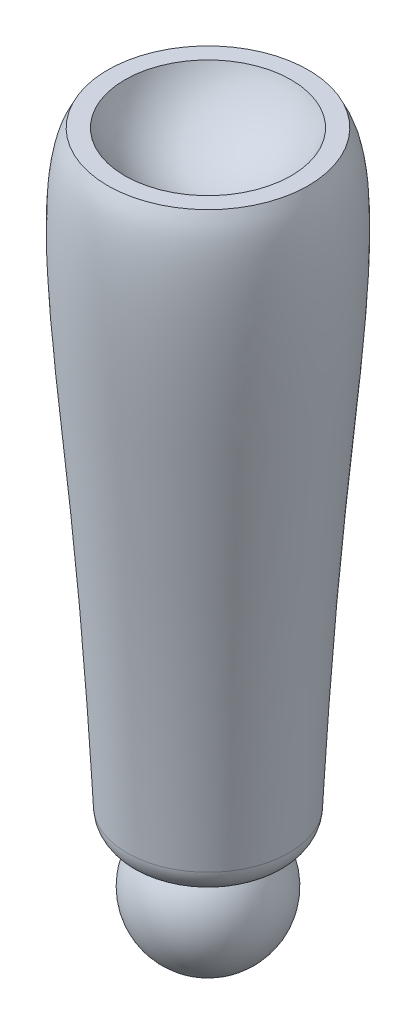
ISO-10303-21;
HEADER;
FILE_DESCRIPTION(('STEP AP214'),'2;1');
FILE_NAME('part.step','',(''),(''),'','','');
FILE_SCHEMA(('AUTOMOTIVE_DESIGN { 1 0 10303 214 1 1 1 1 }'));
ENDSEC;
DATA;
#1=APPLICATION_CONTEXT('core data for automotive mechanical design processes');
#2=APPLICATION_PROTOCOL_DEFINITION('international standard','automotive_design',2000,#1);
#3=PRODUCT_CONTEXT('',#1,'mechanical');
#4=PRODUCT('Part','Part','',(#3));
#5=PRODUCT_RELATED_PRODUCT_CATEGORY('part','',(#4));
#6=PRODUCT_DEFINITION_FORMATION('','',#4);
#7=PRODUCT_DEFINITION_CONTEXT('part definition',#1,'design');
#8=PRODUCT_DEFINITION('design','',#6,#7);
#9=PRODUCT_DEFINITION_SHAPE('','',#8);
#10=(LENGTH_UNIT() NAMED_UNIT(*) SI_UNIT(.MILLI.,.METRE.));
#11=(NAMED_UNIT(*) PLANE_ANGLE_UNIT() SI_UNIT($,.RADIAN.));
#12=(NAMED_UNIT(*) SI_UNIT($,.STERADIAN.) SOLID_ANGLE_UNIT());
#13=UNCERTAINTY_MEASURE_WITH_UNIT(LENGTH_MEASURE(1.E-05),#10,'distance_accuracy_value','');
#14=(GEOMETRIC_REPRESENTATION_CONTEXT(3) GLOBAL_UNCERTAINTY_ASSIGNED_CONTEXT((#13)) GLOBAL_UNIT_ASSIGNED_CONTEXT((#10,
#11,#12)) REPRESENTATION_CONTEXT('',''));
#15=CARTESIAN_POINT('',(0.,0.,0.));
#16=DIRECTION('',(0.,0.,1.));
#17=DIRECTION('',(1.,0.,0.));
#18=AXIS2_PLACEMENT_3D('',#15,#16,#17);
#19=CARTESIAN_POINT('',(1.32722796261031E-05,-162.31971696909,-0.0827450462317538));
#20=DIRECTION('',(0.,1.,0.));
#21=DIRECTION('',(0.,0.,1.));
#22=AXIS2_PLACEMENT_3D('',#19,#20,#21);
#23=PLANE('',#22);
#24=CARTESIAN_POINT('',(1.32722795408896E-05,-162.31971696909,-0.0827450462317538));
#25=DIRECTION('',(0.,1.,0.));
#26=DIRECTION('',(0.,0.,1.));
#27=AXIS2_PLACEMENT_3D('',#24,#25,#26);
#28=CIRCLE('',#27,24.9967477707206);
#29=CARTESIAN_POINT('',(13.3306257436937,-162.31971696909,-21.2282450462318));
#30=VERTEX_POINT('',#29);
#31=CARTESIAN_POINT('',(-13.3305991991346,-162.31971696909,-21.2282450462318));
#32=VERTEX_POINT('',#31);
#33=EDGE_CURVE('E75',#30,#32,#28,.F.);
#34=ORIENTED_EDGE('',*,*,#33,.F.);
#35=DIRECTION('',(1.,0.,0.));
#36=VECTOR('',#35,1.);
#37=CARTESIAN_POINT('',(-194.414215741425,-162.31971696909,-21.2282450462318));
#38=LINE('',#37,#36);
#39=CARTESIAN_POINT('',(17.8139505736692,-162.31971696909,-21.2282450462318));
#40=VERTEX_POINT('',#39);
#41=EDGE_CURVE('E68',#30,#40,#38,.T.);
#42=ORIENTED_EDGE('',*,*,#41,.T.);
#43=CARTESIAN_POINT('',(1.32722795408896E-05,-162.31971696909,-0.0827450462317538));
#44=DIRECTION('',(0.,1.,0.));
#45=DIRECTION('',(0.,0.,1.));
#46=AXIS2_PLACEMENT_3D('',#43,#44,#45);
#47=CIRCLE('',#46,27.6490240773132);
#48=CARTESIAN_POINT('',(-17.8139240291102,-162.31971696909,-21.2282450462317));
#49=VERTEX_POINT('',#48);
#50=EDGE_CURVE('E119',#40,#49,#47,.F.);
#51=ORIENTED_EDGE('',*,*,#50,.T.);
#52=EDGE_CURVE('E55',#49,#32,#38,.T.);
#53=ORIENTED_EDGE('',*,*,#52,.T.);
#54=EDGE_LOOP('',(#34,#42,#51,#53));
#55=FACE_BOUND('',#54,.T.);
#56=ADVANCED_FACE('F36',(#55),#23,.F.);
#57=CARTESIAN_POINT('',(-194.414215741425,-135.88784196909,-42.4419275212938));
#58=DIRECTION('',(0.,0.62592095974027,0.779886499535554));
#59=DIRECTION('',(0.,-0.779886499535554,0.62592095974027));
#60=AXIS2_PLACEMENT_3D('',#57,#58,#59);
#61=PLANE('',#60);
#62=CARTESIAN_POINT('',(1.32722795408896E-05,-186.188943785365,-2.07129161006042));
#63=DIRECTION('',(0.,0.62592095974027,0.779886499535554));
#64=DIRECTION('',(0.,-0.779886499535554,0.62592095974027));
#65=AXIS2_PLACEMENT_3D('',#62,#63,#64);
#66=CIRCLE('',#65,33.3831406944502);
#67=EDGE_CURVE('E11',#32,#30,#66,.F.);
#68=ORIENTED_EDGE('',*,*,#67,.F.);
#69=ORIENTED_EDGE('',*,*,#52,.F.);
#70=CARTESIAN_POINT('',(26.8790454737556,-148.894386349629,-32.0031409203979));
#71=CARTESIAN_POINT('',(27.1055658052952,-149.15208436486,-31.7963177620115));
#72=CARTESIAN_POINT('',(27.3211290923448,-149.415786244221,-31.5846760250242));
#73=CARTESIAN_POINT('',(27.7277989772624,-149.954875456436,-31.1520140449847));
#74=CARTESIAN_POINT('',(27.9188724514648,-150.230277958785,-30.9309816272057));
#75=CARTESIAN_POINT('',(28.2750572928859,-150.794379611781,-30.4782451735751));
#76=CARTESIAN_POINT('',(28.4399089874673,-151.083179071153,-30.2464606319905));
#77=CARTESIAN_POINT('',(28.7381267826506,-151.670431438559,-29.7751438882908));
#78=CARTESIAN_POINT('',(28.8715068854969,-151.968879986092,-29.5356151858244));
#79=CARTESIAN_POINT('',(29.0794460026597,-152.511678582317,-29.0999761300165));
#80=CARTESIAN_POINT('',(29.160460890275,-152.754528249061,-28.9050699525519));
#81=CARTESIAN_POINT('',(29.2985192087608,-153.244276403729,-28.5120080965208));
#82=CARTESIAN_POINT('',(29.3555724200603,-153.4911731969,-28.3138537781293));
#83=CARTESIAN_POINT('',(29.4436579295575,-153.986996503341,-27.915916129492));
#84=CARTESIAN_POINT('',(29.4747729080244,-154.235913993625,-27.7161400409103));
#85=CARTESIAN_POINT('',(29.5093521545412,-154.734920583945,-27.3156475537141));
#86=CARTESIAN_POINT('',(29.5128220381489,-154.985009435714,-27.1149313543534));
#87=CARTESIAN_POINT('',(29.4923345637564,-155.439341803577,-26.7502934847363));
#88=CARTESIAN_POINT('',(29.4732098197557,-155.643720845746,-26.5862630440229));
#89=CARTESIAN_POINT('',(29.4142852247819,-156.050645280426,-26.2596738123226));
#90=CARTESIAN_POINT('',(29.3744895922459,-156.253191038489,-26.097114727951));
#91=CARTESIAN_POINT('',(29.2734933352137,-156.655081730899,-25.7745654748821));
#92=CARTESIAN_POINT('',(29.212287410875,-156.854425859932,-25.6145759525123));
#93=CARTESIAN_POINT('',(29.0680039545436,-157.248264367308,-25.2984892185251));
#94=CARTESIAN_POINT('',(28.9849261387206,-157.442758682677,-25.1423920574474));
#95=CARTESIAN_POINT('',(28.7962233472048,-157.826279777096,-24.8345858681598));
#96=CARTESIAN_POINT('',(28.690471600201,-158.015268733041,-24.6829071959991));
#97=CARTESIAN_POINT('',(28.456987920958,-158.384814941308,-24.3863169646197));
#98=CARTESIAN_POINT('',(28.3292559976794,-158.565372197067,-24.2414054026424));
#99=CARTESIAN_POINT('',(28.0526409930231,-158.916217524071,-23.9598241162251));
#100=CARTESIAN_POINT('',(27.9037695349936,-159.086511165842,-23.8231499209946));
#101=CARTESIAN_POINT('',(27.5860561390149,-159.415350838025,-23.5592299232306));
#102=CARTESIAN_POINT('',(27.4172156647242,-159.573897728049,-23.4319834307902));
#103=CARTESIAN_POINT('',(27.078644732794,-159.8630746032,-23.1998959830179));
#104=CARTESIAN_POINT('',(26.9106132332816,-159.99491865993,-23.09408063864));
#105=CARTESIAN_POINT('',(26.5611315188825,-160.247267474882,-22.8915506390335));
#106=CARTESIAN_POINT('',(26.3796826517426,-160.367773369244,-22.7948350719628));
#107=CARTESIAN_POINT('',(26.0049132221054,-160.597038354135,-22.6108316824139));
#108=CARTESIAN_POINT('',(25.8115895777797,-160.705794374875,-22.5235463236858));
#109=CARTESIAN_POINT('',(25.4147574546156,-160.911369183353,-22.3585561853797));
#110=CARTESIAN_POINT('',(25.2112468506426,-161.008185465591,-22.2808534166658));
#111=CARTESIAN_POINT('',(24.7275060275937,-161.219765809116,-22.1110433587147));
#112=CARTESIAN_POINT('',(24.4440073849993,-161.329999956001,-22.0225716861634));
#113=CARTESIAN_POINT('',(23.8655436095446,-161.530307372585,-21.8618090488996));
#114=CARTESIAN_POINT('',(23.5705747999883,-161.620374114165,-21.7895233235229));
#115=CARTESIAN_POINT('',(22.9722238660815,-161.781667659871,-21.6600724213873));
#116=CARTESIAN_POINT('',(22.6688386829468,-161.852887512636,-21.6029128236487));
#117=CARTESIAN_POINT('',(22.0563952035747,-161.978059745331,-21.5024521488356));
#118=CARTESIAN_POINT('',(21.7473373346071,-162.032013420161,-21.4591500324998));
#119=CARTESIAN_POINT('',(20.7707056115559,-162.177220948466,-21.3426094390517));
#120=CARTESIAN_POINT('',(20.0962487467364,-162.24083582518,-21.2915534396083));
#121=CARTESIAN_POINT('',(19.0814703815551,-162.296361288259,-21.2469898381598));
#122=CARTESIAN_POINT('',(18.7423505208991,-162.30821202038,-21.2374786828474));
#123=CARTESIAN_POINT('',(18.0637472932442,-162.320629979781,-21.2275122825178));
#124=CARTESIAN_POINT('',(17.724263964804,-162.321198304285,-21.2270561568901));
#125=CARTESIAN_POINT('',(17.0425187485754,-162.312918261271,-21.2337015501271));
#126=CARTESIAN_POINT('',(16.7002589991793,-162.30398610637,-21.2408703150328));
#127=CARTESIAN_POINT('',(16.016222907079,-162.278366328505,-21.261432224951));
#128=CARTESIAN_POINT('',(15.6744465768602,-162.261678508775,-21.2748255278837));
#129=CARTESIAN_POINT('',(14.9917250136385,-162.22219198099,-21.3065166077812));
#130=CARTESIAN_POINT('',(14.6507793741712,-162.199397425284,-21.324811052156));
#131=CARTESIAN_POINT('',(13.9694451339348,-162.149163994824,-21.3651273764203));
#132=CARTESIAN_POINT('',(13.6290565587477,-162.121724912505,-21.3871494228976));
#133=CARTESIAN_POINT('',(12.6338079280588,-162.036644570904,-21.455433165598));
#134=CARTESIAN_POINT('',(11.9795850933083,-161.974562021538,-21.5052593504404));
#135=CARTESIAN_POINT('',(10.6717306170474,-161.84663860489,-21.6079280692472));
#136=CARTESIAN_POINT('',(10.0180990262679,-161.780797441391,-21.6607708409482));
#137=CARTESIAN_POINT('',(8.71023229435484,-161.652318054447,-21.7638857701468));
#138=CARTESIAN_POINT('',(8.05599710100058,-161.589680141136,-21.8141576787376));
#139=CARTESIAN_POINT('',(6.74621395654262,-161.473369099316,-21.907506542922));
#140=CARTESIAN_POINT('',(6.0906660759899,-161.419695501444,-21.9505838752167));
#141=CARTESIAN_POINT('',(4.78443861132814,-161.326307700627,-22.0255350148383));
#142=CARTESIAN_POINT('',(4.13377508300827,-161.286460557556,-22.0575155171919));
#143=CARTESIAN_POINT('',(2.8311073124246,-161.223159352985,-22.1083197697861));
#144=CARTESIAN_POINT('',(2.17910307807423,-161.199705195005,-22.1271435974608));
#145=CARTESIAN_POINT('',(0.874586920062719,-161.171018477117,-22.1501669707372));
#146=CARTESIAN_POINT('',(0.222075168728485,-161.165781262056,-22.1543702524709));
#147=CARTESIAN_POINT('',(-1.08275194528825,-161.173927504748,-22.1478322446357));
#148=CARTESIAN_POINT('',(-1.73506730956526,-161.187310807004,-22.1370910798672));
#149=CARTESIAN_POINT('',(-2.88657752757603,-161.226463038296,-22.1056682994995));
#150=CARTESIAN_POINT('',(-3.38598408399595,-161.248613160421,-22.087891064342));
#151=CARTESIAN_POINT('',(-4.38396064330974,-161.302190806154,-22.0448907412718));
#152=CARTESIAN_POINT('',(-4.88253066208423,-161.333618151596,-22.0196677963523));
#153=CARTESIAN_POINT('',(-5.87890782645448,-161.404292360271,-21.9629461214046));
#154=CARTESIAN_POINT('',(-6.37671466789556,-161.443541787029,-21.9314453339436));
#155=CARTESIAN_POINT('',(-7.37149289280398,-161.52794905302,-21.8637017879668));
#156=CARTESIAN_POINT('',(-7.86846427232398,-161.57310692009,-21.8274590071096));
#157=CARTESIAN_POINT('',(-8.86449728552076,-161.667273535446,-21.7518828068617));
#158=CARTESIAN_POINT('',(-9.36355585916118,-161.716301612529,-21.7125338745749));
#159=CARTESIAN_POINT('',(-10.361541293799,-161.815242619822,-21.6331258449715));
#160=CARTESIAN_POINT('',(-10.8604681503527,-161.865155576769,-21.5930667261963));
#161=CARTESIAN_POINT('',(-11.8585301286412,-161.962666436736,-21.5148065035977));
#162=CARTESIAN_POINT('',(-12.3576651229449,-162.0102651167,-21.4766047762139));
#163=CARTESIAN_POINT('',(-13.3567970039365,-162.099516388925,-21.4049735298693));
#164=CARTESIAN_POINT('',(-13.8567938195372,-162.141169449889,-21.3715436347362));
#165=CARTESIAN_POINT('',(-14.8069054221324,-162.21060363147,-21.3158171801822));
#166=CARTESIAN_POINT('',(-15.2568984196062,-162.239367132795,-21.2927321820885));
#167=CARTESIAN_POINT('',(-16.1579747436587,-162.285260575334,-21.2558990433992));
#168=CARTESIAN_POINT('',(-16.6090582116906,-162.302388915898,-21.2421521874516));
#169=CARTESIAN_POINT('',(-17.5113983645621,-162.321069509272,-21.2271595251346));
#170=CARTESIAN_POINT('',(-17.962654479291,-162.322636520535,-21.2259018739321));
#171=CARTESIAN_POINT('',(-18.8645947012474,-162.305813713893,-21.2394035146008));
#172=CARTESIAN_POINT('',(-19.315278911727,-162.287428246494,-21.2541593148437));
#173=CARTESIAN_POINT('',(-20.1266844298387,-162.231792569767,-21.298811371513));
#174=CARTESIAN_POINT('',(-20.4878849655246,-162.198897633056,-21.3252121751799));
#175=CARTESIAN_POINT('',(-21.2067591926684,-162.114230505109,-21.39316428105));
#176=CARTESIAN_POINT('',(-21.5644325750376,-162.062456674327,-21.4347168991189));
#177=CARTESIAN_POINT('',(-22.2730098798028,-161.937379835011,-21.5351010131567));
#178=CARTESIAN_POINT('',(-22.6239239911693,-161.864112463894,-21.5939039072638));
#179=CARTESIAN_POINT('',(-23.3159771506613,-161.69343881725,-21.7308830866359));
#180=CARTESIAN_POINT('',(-23.6571204375275,-161.596043191472,-21.8090508246308));
#181=CARTESIAN_POINT('',(-24.2287653877813,-161.406919932784,-21.9608372854266));
#182=CARTESIAN_POINT('',(-24.4627978220492,-161.321660735228,-22.0292645742602));
#183=CARTESIAN_POINT('',(-24.9217418797484,-161.137364149648,-22.1771772459012));
#184=CARTESIAN_POINT('',(-25.1466560057226,-161.038330575553,-22.256659567727));
#185=CARTESIAN_POINT('',(-25.5852879005868,-160.826263273459,-22.4268604486699));
#186=CARTESIAN_POINT('',(-25.7990093862661,-160.713234235483,-22.51757524367));
#187=CARTESIAN_POINT('',(-26.2132193102489,-160.473243003878,-22.710187299533));
#188=CARTESIAN_POINT('',(-26.4137075833629,-160.346280636373,-22.8120846999455));
#189=CARTESIAN_POINT('',(-26.8005433023294,-160.078075017931,-23.0273410458403));
#190=CARTESIAN_POINT('',(-26.9867969227483,-159.936749296354,-23.1407661805727));
#191=CARTESIAN_POINT('',(-27.3418547577779,-159.641326575674,-23.3778664162696));
#192=CARTESIAN_POINT('',(-27.5106588303569,-159.487229472637,-23.5015416006504));
#193=CARTESIAN_POINT('',(-27.8291754160137,-159.16746758034,-23.758175957873));
#194=CARTESIAN_POINT('',(-27.9788879303661,-159.001802791853,-23.8911351300949));
#195=CARTESIAN_POINT('',(-28.2579747530849,-158.660374166466,-24.165158764319));
#196=CARTESIAN_POINT('',(-28.3873501160213,-158.484610853865,-24.3062228055301));
#197=CARTESIAN_POINT('',(-28.6146820529867,-158.140212886209,-24.5826295731504));
#198=CARTESIAN_POINT('',(-28.7143888256716,-157.972277976778,-24.7174106980297));
#199=CARTESIAN_POINT('',(-28.8959336132085,-157.630573191618,-24.9916559724415));
#200=CARTESIAN_POINT('',(-28.9777655905601,-157.456801367173,-25.1311216859742));
#201=CARTESIAN_POINT('',(-29.123489831313,-157.104819024646,-25.4136155178037));
#202=CARTESIAN_POINT('',(-29.1873880932703,-156.926610012503,-25.5566424274652));
#203=CARTESIAN_POINT('',(-29.2975471038987,-156.566854108543,-25.8453751607699));
#204=CARTESIAN_POINT('',(-29.343801243371,-156.385305992594,-25.9910819668781));
#205=CARTESIAN_POINT('',(-29.4213750259596,-156.008881928468,-26.2931922247522));
#206=CARTESIAN_POINT('',(-29.4516087565558,-155.813869724874,-26.4497050323297));
#207=CARTESIAN_POINT('',(-29.493382434931,-155.422608843092,-26.7637230167156));
#208=CARTESIAN_POINT('',(-29.5049149964859,-155.226359707069,-26.9212285609722));
#209=CARTESIAN_POINT('',(-29.5126283628587,-154.637362643487,-27.3939455621526));
#210=CARTESIAN_POINT('',(-29.4819520884661,-154.24422615817,-27.7094688675888));
#211=CARTESIAN_POINT('',(-29.3730401241236,-153.568382322653,-28.251887312341));
#212=CARTESIAN_POINT('',(-29.3096002185177,-153.284078156775,-28.4800640232736));
#213=CARTESIAN_POINT('',(-29.1510241073392,-152.720751826569,-28.9321782186843));
#214=CARTESIAN_POINT('',(-29.0558744253035,-152.441731961412,-29.1561138578957));
#215=CARTESIAN_POINT('',(-28.8365659487695,-151.890249612249,-29.598722316272));
#216=CARTESIAN_POINT('',(-28.7123568886805,-151.617799403275,-29.8173852837471));
#217=CARTESIAN_POINT('',(-28.4377046623809,-151.081037799564,-30.2481791727898));
#218=CARTESIAN_POINT('',(-28.2872561490938,-150.816728076636,-30.460308752597));
#219=CARTESIAN_POINT('',(-27.9440167596141,-150.267324582752,-30.9012487642286));
#220=CARTESIAN_POINT('',(-27.7483477023473,-149.983328380657,-31.1291783097245));
#221=CARTESIAN_POINT('',(-27.3318568906271,-149.428954307945,-31.5741076062999));
#222=CARTESIAN_POINT('',(-27.1111862757137,-149.158507505596,-31.7911626805782));
#223=CARTESIAN_POINT('',(-26.8790189291965,-148.894386349629,-32.0031409203979));
#224=B_SPLINE_CURVE_WITH_KNOTS('',3,(#70,#71,#72,#73,#74,#75,#76,#77,#78,#79,#80,#81,#82,#83,
#84,#85,#86,#87,#88,#89,#90,#91,#92,#93,#94,#95,#96,#97,#98,#99,#100,#101,#102,#103,#104,#105,
#106,#107,#108,#109,#110,#111,#112,#113,#114,#115,#116,#117,#118,#119,#120,#121,#122,#123,#124,
#125,#126,#127,#128,#129,#130,#131,#132,#133,#134,#135,#136,#137,#138,#139,#140,#141,#142,#143,
#144,#145,#146,#147,#148,#149,#150,#151,#152,#153,#154,#155,#156,#157,#158,#159,#160,#161,#162,
#163,#164,#165,#166,#167,#168,#169,#170,#171,#172,#173,#174,#175,#176,#177,#178,#179,#180,#181,
#182,#183,#184,#185,#186,#187,#188,#189,#190,#191,#192,#193,#194,#195,#196,#197,#198,#199,#200,
#201,#202,#203,#204,#205,#206,#207,#208,#209,#210,#211,#212,#213,#214,#215,#216,#217,#218,#219,
#220,#221,#222,#223),.UNSPECIFIED.,.F.,.F.,(4,2,2,2,2,2,2,2,2,2,2,2,2,2,2,2,2,2,2,2,2,2,2,2,2,2,
2,2,2,2,2,2,2,2,2,2,2,2,2,2,2,2,2,2,2,2,2,2,2,2,2,2,2,2,2,2,2,2,2,2,2,2,2,2,2,2,2,2,2,2,2,2,2,2,
2,2,4),(0.,1.20186512041241,2.40533904232176,3.6200745240756,4.83426852601993,5.79869677635982,
6.76273099287633,7.72368039111945,8.68443458639425,9.47195446354291,10.2593136897085,
11.0468679546077,11.8344324400521,12.6265207489878,13.4186087350173,14.2102628742734,
15.0018590239879,15.7161074581448,16.4302842447251,17.1446471692529,17.8591597455196,
18.8080466070771,19.757240177471,20.7067833556974,21.6562553049064,23.6886012743598,
24.7068380663272,25.7249758332958,26.7521678773003,27.7793859831877,28.8059073848219,
29.8324746742025,31.8095223089494,33.7867259701206,35.7641206999906,37.7414118629169,
39.6991274347447,41.6568314842714,43.6140352256622,45.5712226226557,47.0717139598088,
48.5721764822305,50.0731315612002,51.574093712003,53.0830945290336,54.592141018861,
56.1006773455768,57.6090946858103,58.9634283283311,60.3179482487679,61.6711834119578,
63.0241235703629,64.1144082391619,65.2047876167484,66.2933692090328,67.3814711757007,
68.1557161513162,68.9297471746893,69.7035195107734,70.4773015039881,71.255808522137,
72.0343218764965,72.8128351788758,73.5913080986203,74.3024006753577,75.0137330649484,
75.7248272403002,76.4361875189118,77.1910374225639,77.9461853895935,79.4559457799694,
80.5647139027805,81.6739538475431,82.7851268794666,83.8965266113911,85.1355214153559,
86.3673900901502),.UNSPECIFIED.);
#225=CARTESIAN_POINT('',(-26.8799945784904,-148.895496349627,-32.002250057093));
#226=VERTEX_POINT('',#225);
#227=EDGE_CURVE('E127',#49,#226,#224,.T.);
#228=ORIENTED_EDGE('',*,*,#227,.T.);
#229=CARTESIAN_POINT('',(26.8800211230494,-148.895496349627,-32.002250057093));
#230=CARTESIAN_POINT('',(26.4578530275185,-148.415180222649,-32.3877419605377));
#231=CARTESIAN_POINT('',(26.023310416591,-147.941391777371,-32.7679948801089));
#232=CARTESIAN_POINT('',(25.1278672154922,-147.007801919993,-33.5172750123867));
#233=CARTESIAN_POINT('',(24.6669173921624,-146.548029255434,-33.886279152905));
#234=CARTESIAN_POINT('',(23.7183634240472,-145.64497455661,-34.6110523912193));
#235=CARTESIAN_POINT('',(23.2307420240034,-145.201703517311,-34.96681266468));
#236=CARTESIAN_POINT('',(22.2222604881301,-144.328785930946,-35.6673984726879));
#237=CARTESIAN_POINT('',(21.7010646478091,-143.899374767842,-36.0120350928803));
#238=CARTESIAN_POINT('',(20.63066179985,-143.062764541601,-36.6834813559568));
#239=CARTESIAN_POINT('',(20.0814708196043,-142.655553039345,-37.0103009822248));
#240=CARTESIAN_POINT('',(18.9546530034331,-141.866092100526,-37.6439061911845));
#241=CARTESIAN_POINT('',(18.3770366241818,-141.483833603279,-37.9506990457963));
#242=CARTESIAN_POINT('',(17.1134746039479,-140.697764693858,-38.5815818813113));
#243=CARTESIAN_POINT('',(16.4234039561368,-140.297963880353,-38.9024538402991));
#244=CARTESIAN_POINT('',(15.0068562016702,-139.539514066328,-39.5111701545215));
#245=CARTESIAN_POINT('',(14.2803777081468,-139.180866635161,-39.7990132502263));
#246=CARTESIAN_POINT('',(12.7957796516041,-138.5117585114,-40.3360257504343));
#247=CARTESIAN_POINT('',(12.0378076243956,-138.201099575756,-40.5853542607572));
#248=CARTESIAN_POINT('',(10.490284427218,-137.63194080123,-41.0421494567354));
#249=CARTESIAN_POINT('',(9.70073917174213,-137.373431247737,-41.2496239391384));
#250=CARTESIAN_POINT('',(8.21827542531938,-136.949535648575,-41.5898338804768));
#251=CARTESIAN_POINT('',(7.52921184263371,-136.7759384227,-41.7291594647667));
#252=CARTESIAN_POINT('',(6.13522060279313,-136.473094502886,-41.972215803163));
#253=CARTESIAN_POINT('',(5.43029448247974,-136.343843532006,-42.0759499898539));
#254=CARTESIAN_POINT('',(4.00875152895405,-136.132159382088,-42.2458433606935));
#255=CARTESIAN_POINT('',(3.29213183035949,-136.049737860842,-42.3119931885364));
#256=CARTESIAN_POINT('',(1.85239111959096,-135.933465658216,-42.4053108811779));
#257=CARTESIAN_POINT('',(1.1292699238481,-135.899616352626,-42.4324776417947));
#258=CARTESIAN_POINT('',(-0.318930632503071,-135.881210863538,-42.4472495110364));
#259=CARTESIAN_POINT('',(-1.04401131422788,-135.896717575241,-42.4348041412583));
#260=CARTESIAN_POINT('',(-2.48962429436353,-135.97682201642,-42.3705139545047));
#261=CARTESIAN_POINT('',(-3.21015693213367,-136.041416038445,-42.3186721130528));
#262=CARTESIAN_POINT('',(-4.64145551141852,-136.218321447842,-42.1766914483037));
#263=CARTESIAN_POINT('',(-5.35222178544401,-136.330631206482,-42.0865539321932));
#264=CARTESIAN_POINT('',(-6.75959391921356,-136.600772694715,-41.8697438967822));
#265=CARTESIAN_POINT('',(-7.45619462482236,-136.758620686993,-41.7430583253843));
#266=CARTESIAN_POINT('',(-8.8238090314899,-137.115029014263,-41.4570122886889));
#267=CARTESIAN_POINT('',(-9.4950151130309,-137.313142382506,-41.2980105497665));
#268=CARTESIAN_POINT('',(-10.8167707156238,-137.747958979823,-40.9490356385899));
#269=CARTESIAN_POINT('',(-11.4673124190057,-137.984676610578,-40.7590509078399));
#270=CARTESIAN_POINT('',(-12.7459319362658,-138.493521743421,-40.3506622075638));
#271=CARTESIAN_POINT('',(-13.3739870619088,-138.765683791735,-40.1322305119421));
#272=CARTESIAN_POINT('',(-14.6056726669373,-139.341937686408,-39.6697409175946));
#273=CARTESIAN_POINT('',(-15.2092973798074,-139.646037010996,-39.4256770169936));
#274=CARTESIAN_POINT('',(-16.2677053427514,-140.21636504842,-38.9679433945192));
#275=CARTESIAN_POINT('',(-16.7272539685807,-140.477246448349,-38.7585653166591));
#276=CARTESIAN_POINT('',(-17.6301554206409,-141.015371313323,-38.3266773019988));
#277=CARTESIAN_POINT('',(-18.0735107974571,-141.292612183452,-38.1041694478257));
#278=CARTESIAN_POINT('',(-19.3787312408937,-142.146436353813,-37.4189076251376));
#279=CARTESIAN_POINT('',(-20.2165541899778,-142.745559002103,-36.938064036688));
#280=CARTESIAN_POINT('',(-21.8292825741974,-143.994217627936,-35.9359161524322));
#281=CARTESIAN_POINT('',(-22.6041113262843,-144.643813220306,-35.4145640109836));
#282=CARTESIAN_POINT('',(-24.0919251126369,-145.984476472796,-34.3385750944087));
#283=CARTESIAN_POINT('',(-24.8049225401906,-146.675535774851,-33.7839450272933));
#284=CARTESIAN_POINT('',(-25.7276144358001,-147.631942959942,-33.0163521742931));
#285=CARTESIAN_POINT('',(-25.9633936877834,-147.882230770619,-32.8154762945806));
#286=CARTESIAN_POINT('',(-26.4272628035598,-148.386221987509,-32.4109832480102));
#287=CARTESIAN_POINT('',(-26.6553692907541,-148.639916085529,-32.2073735517171));
#288=CARTESIAN_POINT('',(-26.8799945784904,-148.895496349627,-32.002250057093));
#289=B_SPLINE_CURVE_WITH_KNOTS('',3,(#229,#230,#231,#232,#233,#234,#235,#236,#237,#238,#239,
#240,#241,#242,#243,#244,#245,#246,#247,#248,#249,#250,#251,#252,#253,#254,#255,#256,#257,#258,
#259,#260,#261,#262,#263,#264,#265,#266,#267,#268,#269,#270,#271,#272,#273,#274,#275,#276,#277,
#278,#279,#280,#281,#282,#283,#284,#285,#286,#287,#288),.UNSPECIFIED.,.F.,.F.,(4,2,2,2,2,2,2,2,
2,2,2,2,2,2,2,2,2,2,2,2,2,2,2,2,2,2,2,2,2,4),(0.,2.24003344311225,4.48438841601349,
6.73021296212675,9.00372888739789,11.2759575174901,13.5473564357856,16.124067820207,
18.7008774328672,21.2667397444981,23.8321236340181,26.0022533681079,28.1721737468641,
30.3426340723908,32.5131558742381,34.6864447153296,36.8595694293,39.032619971674,
41.2064475198773,43.3573469791609,45.5090506949906,47.6628675073826,49.8171897731065,
51.5217682525245,53.2260770770763,56.6317648661267,60.0415381989222,63.4506264995176,
64.6452512289174,65.8370948119735),.UNSPECIFIED.);
#290=CARTESIAN_POINT('',(26.8800211230494,-148.895496349627,-32.002250057093));
#291=VERTEX_POINT('',#290);
#292=EDGE_CURVE('E116',#291,#226,#289,.T.);
#293=ORIENTED_EDGE('',*,*,#292,.F.);
#294=EDGE_CURVE('E46',#291,#40,#224,.T.);
#295=ORIENTED_EDGE('',*,*,#294,.T.);
#296=ORIENTED_EDGE('',*,*,#41,.F.);
#297=EDGE_LOOP('',(#68,#69,#228,#293,#295,#296));
#298=FACE_BOUND('',#297,.T.);
#299=ADVANCED_FACE('F70',(#298),#61,.F.);
#300=CARTESIAN_POINT('',(1.32722795293424E-05,153.73502303091,-0.0827450462317538));
#301=DIRECTION('',(0.,-1.,0.));
#302=DIRECTION('',(0.,0.,-1.));
#303=AXIS2_PLACEMENT_3D('',#300,#301,#302);
#304=PLANE('',#303);
#305=CARTESIAN_POINT('',(1.32722795408896E-05,153.73502303091,-0.0827450462317538));
#306=DIRECTION('',(0.,-1.,0.));
#307=DIRECTION('',(0.,0.,-1.));
#308=AXIS2_PLACEMENT_3D('',#305,#306,#307);
#309=CIRCLE('',#308,42.8400384826718);
#310=CARTESIAN_POINT('',(1.32722795408896E-05,153.73502303091,-42.9227835289035));
#311=VERTEX_POINT('',#310);
#312=EDGE_CURVE('E41',#311,#311,#309,.T.);
#313=ORIENTED_EDGE('',*,*,#312,.T.);
#314=EDGE_LOOP('',(#313));
#315=FACE_BOUND('',#314,.T.);
#316=CARTESIAN_POINT('',(1.32722795408896E-05,153.73502303091,-0.0827450462317538));
#317=DIRECTION('',(0.,1.,0.));
#318=DIRECTION('',(0.,0.,1.));
#319=AXIS2_PLACEMENT_3D('',#316,#317,#318);
#320=CIRCLE('',#319,51.665505);
#321=CARTESIAN_POINT('',(1.32722795408896E-05,153.73502303091,51.5827599537683));
#322=VERTEX_POINT('',#321);
#323=EDGE_CURVE('E113',#322,#322,#320,.T.);
#324=ORIENTED_EDGE('',*,*,#323,.T.);
#325=EDGE_LOOP('',(#324));
#326=FACE_BOUND('',#325,.T.);
#327=ADVANCED_FACE('F98',(#315,#326),#304,.F.);
#328=CARTESIAN_POINT('',(41.0927682722796,-162.31971696909,-0.0827450462317538));
#329=CARTESIAN_POINT('',(43.3408075872585,-114.802643886807,-0.0827450462317538));
#330=CARTESIAN_POINT('',(47.6240607265005,-24.2670153098701,-0.0827450462317538));
#331=CARTESIAN_POINT('',(64.5053653565531,128.759464200353,-0.0827450462317538));
#332=CARTESIAN_POINT('',(52.8041846715804,151.520134531268,-0.0827450462317538));
#333=CARTESIAN_POINT('',(51.6655182722796,153.73502303091,-0.0827450462317538));
#334=B_SPLINE_CURVE_WITH_KNOTS('',3,(#328,#329,#330,#331,#332,#333),.UNSPECIFIED.,.F.,.F.,(4,1,
1,4),(0.,0.499269782829045,0.951272893842294,1.),.UNSPECIFIED.);
#335=CARTESIAN_POINT('',(1.32722795408896E-05,533.524373678683,-0.0827450462317538));
#336=DIRECTION('',(0.,1.,0.));
#337=AXIS1_PLACEMENT('',#335,#336);
#338=SURFACE_OF_REVOLUTION('',#334,#337);
#339=CARTESIAN_POINT('',(1.32722795408896E-05,-148.895496349627,-0.0827450462317538));
#340=DIRECTION('',(0.,1.,0.));
#341=DIRECTION('',(0.,0.,1.));
#342=AXIS2_PLACEMENT_3D('',#339,#340,#341);
#343=CIRCLE('',#342,41.7299607260281);
#344=EDGE_CURVE('E115',#226,#291,#343,.T.);
#345=ORIENTED_EDGE('',*,*,#344,.T.);
#346=ORIENTED_EDGE('',*,*,#292,.T.);
#347=EDGE_LOOP('',(#345,#346));
#348=FACE_BOUND('',#347,.T.);
#349=ORIENTED_EDGE('',*,*,#323,.F.);
#350=EDGE_LOOP('',(#349));
#351=FACE_BOUND('',#350,.T.);
#352=ADVANCED_FACE('F90',(#348,#351),#338,.T.);
#353=CARTESIAN_POINT('',(1.32722795408896E-05,-148.22271696909,-0.0827450462317538));
#354=DIRECTION('',(0.,1.,0.));
#355=DIRECTION('',(0.,0.,1.));
#356=AXIS2_PLACEMENT_3D('',#353,#354,#355);
#357=TOROIDAL_SURFACE('',#356,27.6490240773132,14.097);
#358=ORIENTED_EDGE('',*,*,#294,.F.);
#359=ORIENTED_EDGE('',*,*,#344,.F.);
#360=ORIENTED_EDGE('',*,*,#227,.F.);
#361=ORIENTED_EDGE('',*,*,#50,.F.);
#362=EDGE_LOOP('',(#358,#359,#360,#361));
#363=FACE_BOUND('',#362,.T.);
#364=ADVANCED_FACE('F38',(#363),#357,.T.);
#365=CARTESIAN_POINT('',(1.32722795408896E-05,-184.59297696909,-0.0827450462317538));
#366=DIRECTION('',(0.,1.,0.));
#367=DIRECTION('',(1.,0.,0.));
#368=AXIS2_PLACEMENT_3D('',#365,#366,#367);
#369=SPHERICAL_SURFACE('',#368,33.480375);
#370=ORIENTED_EDGE('',*,*,#67,.T.);
#371=ORIENTED_EDGE('',*,*,#33,.T.);
#372=EDGE_LOOP('',(#370,#371));
#373=FACE_BOUND('',#372,.T.);
#374=ADVANCED_FACE('F80',(#373),#369,.T.);
#375=CARTESIAN_POINT('',(1.32722795408896E-05,170.36948303091,-0.0827450462317538));
#376=DIRECTION('',(0.,-1.,0.));
#377=DIRECTION('',(-1.,0.,0.));
#378=AXIS2_PLACEMENT_3D('',#375,#376,#377);
#379=SPHERICAL_SURFACE('',#378,45.95622);
#380=ORIENTED_EDGE('',*,*,#312,.F.);
#381=EDGE_LOOP('',(#380));
#382=FACE_BOUND('',#381,.T.);
#383=ADVANCED_FACE('F82',(#382),#379,.F.);
#384=CLOSED_SHELL('',(#56,#299,#327,#352,#364,#374,#383));
#385=MANIFOLD_SOLID_BREP('B2',#384);
#386=ADVANCED_BREP_SHAPE_REPRESENTATION('',(#18,#385),#14);
#387=SHAPE_DEFINITION_REPRESENTATION(#9,#386);
ENDSEC;
END-ISO-10303-21;
